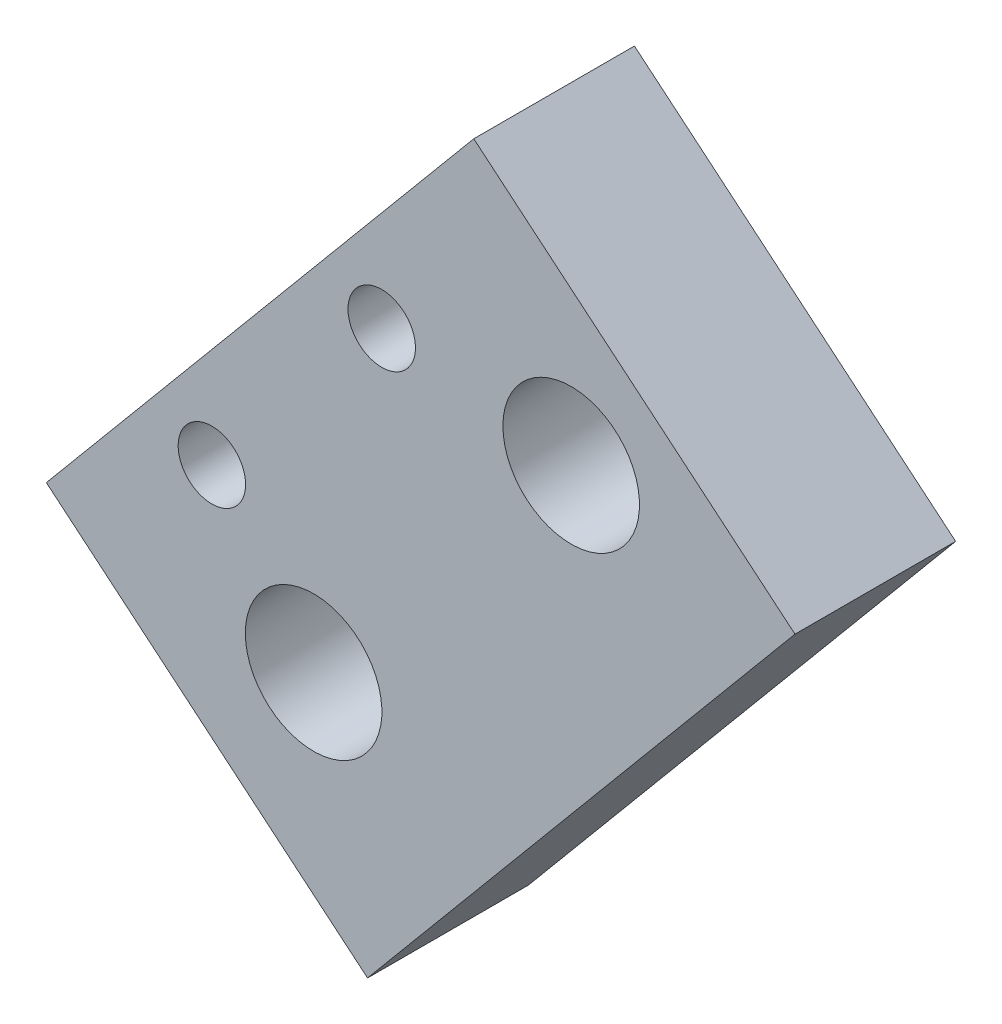
ISO-10303-21;
HEADER;
FILE_DESCRIPTION(('STEP AP214'),'2;1');
FILE_NAME('part.step','',(''),(''),'','','');
FILE_SCHEMA(('AUTOMOTIVE_DESIGN { 1 0 10303 214 1 1 1 1 }'));
ENDSEC;
DATA;
#1=APPLICATION_CONTEXT('core data for automotive mechanical design processes');
#2=APPLICATION_PROTOCOL_DEFINITION('international standard','automotive_design',2000,#1);
#3=PRODUCT_CONTEXT('',#1,'mechanical');
#4=PRODUCT('Part','Part','',(#3));
#5=PRODUCT_RELATED_PRODUCT_CATEGORY('part','',(#4));
#6=PRODUCT_DEFINITION_FORMATION('','',#4);
#7=PRODUCT_DEFINITION_CONTEXT('part definition',#1,'design');
#8=PRODUCT_DEFINITION('design','',#6,#7);
#9=PRODUCT_DEFINITION_SHAPE('','',#8);
#10=(LENGTH_UNIT() NAMED_UNIT(*) SI_UNIT(.MILLI.,.METRE.));
#11=(NAMED_UNIT(*) PLANE_ANGLE_UNIT() SI_UNIT($,.RADIAN.));
#12=(NAMED_UNIT(*) SI_UNIT($,.STERADIAN.) SOLID_ANGLE_UNIT());
#13=UNCERTAINTY_MEASURE_WITH_UNIT(LENGTH_MEASURE(1.E-05),#10,'distance_accuracy_value','');
#14=(GEOMETRIC_REPRESENTATION_CONTEXT(3) GLOBAL_UNCERTAINTY_ASSIGNED_CONTEXT((#13)) GLOBAL_UNIT_ASSIGNED_CONTEXT((#10,
#11,#12)) REPRESENTATION_CONTEXT('',''));
#15=CARTESIAN_POINT('',(0.,0.,0.));
#16=DIRECTION('',(0.,0.,1.));
#17=DIRECTION('',(1.,0.,0.));
#18=AXIS2_PLACEMENT_3D('',#15,#16,#17);
#19=CARTESIAN_POINT('',(0.,0.,3296.87018726518));
#20=DIRECTION('',(0.,0.,-1.));
#21=DIRECTION('',(-1.,0.,0.));
#22=AXIS2_PLACEMENT_3D('',#19,#20,#21);
#23=PLANE('',#22);
#24=CARTESIAN_POINT('',(93.357902825932,530.766140136634,3296.87018726518));
#25=DIRECTION('',(0.,0.,-1.));
#26=DIRECTION('',(-1.,0.,0.));
#27=AXIS2_PLACEMENT_3D('',#24,#25,#26);
#28=CIRCLE('',#27,4.24999999999999);
#29=CARTESIAN_POINT('',(89.107902825932,530.766140136634,3296.87018726518));
#30=VERTEX_POINT('',#29);
#31=EDGE_CURVE('E121',#30,#30,#28,.T.);
#32=ORIENTED_EDGE('',*,*,#31,.F.);
#33=EDGE_LOOP('',(#32));
#34=FACE_BOUND('',#33,.T.);
#35=CARTESIAN_POINT('',(77.3269662880733,511.582577544687,3296.87018726518));
#36=DIRECTION('',(0.,0.,-1.));
#37=DIRECTION('',(-1.,0.,0.));
#38=AXIS2_PLACEMENT_3D('',#35,#36,#37);
#39=CIRCLE('',#38,4.24999999999998);
#40=CARTESIAN_POINT('',(73.0769662880733,511.582577544687,3296.87018726518));
#41=VERTEX_POINT('',#40);
#42=EDGE_CURVE('E100',#41,#41,#39,.T.);
#43=ORIENTED_EDGE('',*,*,#42,.F.);
#44=EDGE_LOOP('',(#43));
#45=FACE_BOUND('',#44,.T.);
#46=DIRECTION('',(-0.641237461514351,-0.767342503677876,0.));
#47=VECTOR('',#46,1.);
#48=CARTESIAN_POINT('',(107.287132076453,528.630767377992,3296.87018726518));
#49=LINE('',#48,#47);
#50=CARTESIAN_POINT('',(107.287132076453,528.630767377992,3296.87018726518));
#51=VERTEX_POINT('',#50);
#52=CARTESIAN_POINT('',(80.6837556077913,496.795600640325,3296.87018726518));
#53=VERTEX_POINT('',#52);
#54=EDGE_CURVE('E85',#51,#53,#49,.T.);
#55=ORIENTED_EDGE('',*,*,#54,.T.);
#56=DIRECTION('',(-0.767342503677874,0.641237461514354,0.));
#57=VECTOR('',#56,1.);
#58=CARTESIAN_POINT('',(80.6837556077913,496.795600640325,3296.87018726518));
#59=LINE('',#58,#57);
#60=CARTESIAN_POINT('',(60.692285166123,513.501673478089,3296.87018726518));
#61=VERTEX_POINT('',#60);
#62=EDGE_CURVE('E80',#53,#61,#59,.T.);
#63=ORIENTED_EDGE('',*,*,#62,.T.);
#64=DIRECTION('',(0.641237461514352,0.767342503677875,0.));
#65=VECTOR('',#64,1.);
#66=CARTESIAN_POINT('',(87.2956616347843,545.336840215756,3296.87018726518));
#67=LINE('',#66,#65);
#68=CARTESIAN_POINT('',(87.2956616347843,545.336840215756,3296.87018726518));
#69=VERTEX_POINT('',#68);
#70=EDGE_CURVE('E83',#61,#69,#67,.T.);
#71=ORIENTED_EDGE('',*,*,#70,.T.);
#72=DIRECTION('',(0.767342503677875,-0.641237461514352,0.));
#73=VECTOR('',#72,1.);
#74=CARTESIAN_POINT('',(107.287132076453,528.630767377992,3296.87018726518));
#75=LINE('',#74,#73);
#76=EDGE_CURVE('E50',#69,#51,#75,.T.);
#77=ORIENTED_EDGE('',*,*,#76,.T.);
#78=EDGE_LOOP('',(#55,#63,#71,#77));
#79=FACE_BOUND('',#78,.T.);
#80=CARTESIAN_POINT('',(81.5669368911053,532.251222864898,3296.87018726518));
#81=DIRECTION('',(0.,0.,-1.));
#82=DIRECTION('',(-1.,0.,0.));
#83=AXIS2_PLACEMENT_3D('',#80,#81,#82);
#84=CIRCLE('',#83,2.09999999999989);
#85=CARTESIAN_POINT('',(79.4669368911054,532.251222864898,3296.87018726518));
#86=VERTEX_POINT('',#85);
#87=EDGE_CURVE('E115',#86,#86,#84,.T.);
#88=ORIENTED_EDGE('',*,*,#87,.F.);
#89=EDGE_LOOP('',(#88));
#90=FACE_BOUND('',#89,.T.);
#91=CARTESIAN_POINT('',(70.9944969603028,519.599618719178,3296.87018726518));
#92=DIRECTION('',(0.,0.,-1.));
#93=DIRECTION('',(-1.,0.,0.));
#94=AXIS2_PLACEMENT_3D('',#91,#92,#93);
#95=CIRCLE('',#94,2.09999999999995);
#96=CARTESIAN_POINT('',(68.8944969603028,519.599618719178,3296.87018726518));
#97=VERTEX_POINT('',#96);
#98=EDGE_CURVE('E127',#97,#97,#95,.T.);
#99=ORIENTED_EDGE('',*,*,#98,.F.);
#100=EDGE_LOOP('',(#99));
#101=FACE_BOUND('',#100,.T.);
#102=ADVANCED_FACE('F33',(#34,#45,#79,#90,#101),#23,.T.);
#103=CARTESIAN_POINT('',(0.,0.,3306.87018726518));
#104=DIRECTION('',(0.,0.,-1.));
#105=DIRECTION('',(-1.,0.,0.));
#106=AXIS2_PLACEMENT_3D('',#103,#104,#105);
#107=PLANE('',#106);
#108=DIRECTION('',(-0.641237461514351,-0.767342503677876,0.));
#109=VECTOR('',#108,1.);
#110=CARTESIAN_POINT('',(107.287132076453,528.630767377992,3306.87018726518));
#111=LINE('',#110,#109);
#112=CARTESIAN_POINT('',(107.287132076453,528.630767377992,3306.87018726518));
#113=VERTEX_POINT('',#112);
#114=CARTESIAN_POINT('',(80.6837556077913,496.795600640325,3306.87018726518));
#115=VERTEX_POINT('',#114);
#116=EDGE_CURVE('E97',#113,#115,#111,.T.);
#117=ORIENTED_EDGE('',*,*,#116,.F.);
#118=DIRECTION('',(0.767342503677875,-0.641237461514352,0.));
#119=VECTOR('',#118,1.);
#120=CARTESIAN_POINT('',(107.287132076453,528.630767377992,3306.87018726518));
#121=LINE('',#120,#119);
#122=CARTESIAN_POINT('',(87.2956616347843,545.336840215756,3306.87018726518));
#123=VERTEX_POINT('',#122);
#124=EDGE_CURVE('E73',#123,#113,#121,.T.);
#125=ORIENTED_EDGE('',*,*,#124,.F.);
#126=DIRECTION('',(0.641237461514352,0.767342503677875,0.));
#127=VECTOR('',#126,1.);
#128=CARTESIAN_POINT('',(87.2956616347843,545.336840215756,3306.87018726518));
#129=LINE('',#128,#127);
#130=CARTESIAN_POINT('',(60.692285166123,513.501673478089,3306.87018726518));
#131=VERTEX_POINT('',#130);
#132=EDGE_CURVE('E67',#131,#123,#129,.T.);
#133=ORIENTED_EDGE('',*,*,#132,.F.);
#134=DIRECTION('',(-0.767342503677874,0.641237461514354,0.));
#135=VECTOR('',#134,1.);
#136=CARTESIAN_POINT('',(80.6837556077913,496.795600640325,3306.87018726518));
#137=LINE('',#136,#135);
#138=EDGE_CURVE('E89',#115,#131,#137,.T.);
#139=ORIENTED_EDGE('',*,*,#138,.F.);
#140=EDGE_LOOP('',(#117,#125,#133,#139));
#141=FACE_BOUND('',#140,.T.);
#142=CARTESIAN_POINT('',(77.3269662880733,511.582577544687,3306.87018726518));
#143=DIRECTION('',(0.,0.,-1.));
#144=DIRECTION('',(-1.,0.,0.));
#145=AXIS2_PLACEMENT_3D('',#142,#143,#144);
#146=CIRCLE('',#145,4.24999999999998);
#147=CARTESIAN_POINT('',(73.0769662880733,511.582577544687,3306.87018726518));
#148=VERTEX_POINT('',#147);
#149=EDGE_CURVE('E112',#148,#148,#146,.T.);
#150=ORIENTED_EDGE('',*,*,#149,.T.);
#151=EDGE_LOOP('',(#150));
#152=FACE_BOUND('',#151,.T.);
#153=CARTESIAN_POINT('',(81.5669368911053,532.251222864898,3306.87018726518));
#154=DIRECTION('',(0.,0.,-1.));
#155=DIRECTION('',(-1.,0.,0.));
#156=AXIS2_PLACEMENT_3D('',#153,#154,#155);
#157=CIRCLE('',#156,2.09999999999989);
#158=CARTESIAN_POINT('',(79.4669368911054,532.251222864898,3306.87018726518));
#159=VERTEX_POINT('',#158);
#160=EDGE_CURVE('E118',#159,#159,#157,.T.);
#161=ORIENTED_EDGE('',*,*,#160,.T.);
#162=EDGE_LOOP('',(#161));
#163=FACE_BOUND('',#162,.T.);
#164=CARTESIAN_POINT('',(93.357902825932,530.766140136634,3306.87018726518));
#165=DIRECTION('',(0.,0.,-1.));
#166=DIRECTION('',(-1.,0.,0.));
#167=AXIS2_PLACEMENT_3D('',#164,#165,#166);
#168=CIRCLE('',#167,4.24999999999999);
#169=CARTESIAN_POINT('',(89.107902825932,530.766140136634,3306.87018726518));
#170=VERTEX_POINT('',#169);
#171=EDGE_CURVE('E124',#170,#170,#168,.T.);
#172=ORIENTED_EDGE('',*,*,#171,.T.);
#173=EDGE_LOOP('',(#172));
#174=FACE_BOUND('',#173,.T.);
#175=CARTESIAN_POINT('',(70.9944969603028,519.599618719178,3306.87018726518));
#176=DIRECTION('',(0.,0.,-1.));
#177=DIRECTION('',(-1.,0.,0.));
#178=AXIS2_PLACEMENT_3D('',#175,#176,#177);
#179=CIRCLE('',#178,2.09999999999995);
#180=CARTESIAN_POINT('',(68.8944969603028,519.599618719178,3306.87018726518));
#181=VERTEX_POINT('',#180);
#182=EDGE_CURVE('E130',#181,#181,#179,.T.);
#183=ORIENTED_EDGE('',*,*,#182,.T.);
#184=EDGE_LOOP('',(#183));
#185=FACE_BOUND('',#184,.T.);
#186=ADVANCED_FACE('F108',(#141,#152,#163,#174,#185),#107,.F.);
#187=CARTESIAN_POINT('',(107.287132076453,528.630767377992,3296.87018726518));
#188=DIRECTION('',(-0.767342503677876,0.641237461514351,0.));
#189=DIRECTION('',(-0.641237461514351,-0.767342503677876,0.));
#190=AXIS2_PLACEMENT_3D('',#187,#188,#189);
#191=PLANE('',#190);
#192=ORIENTED_EDGE('',*,*,#116,.T.);
#193=DIRECTION('',(0.,0.,1.));
#194=VECTOR('',#193,1.);
#195=CARTESIAN_POINT('',(80.6837556077913,496.795600640325,3296.87018726518));
#196=LINE('',#195,#194);
#197=EDGE_CURVE('E11',#53,#115,#196,.T.);
#198=ORIENTED_EDGE('',*,*,#197,.F.);
#199=ORIENTED_EDGE('',*,*,#54,.F.);
#200=DIRECTION('',(0.,0.,1.));
#201=VECTOR('',#200,1.);
#202=CARTESIAN_POINT('',(107.287132076453,528.630767377992,3296.87018726518));
#203=LINE('',#202,#201);
#204=EDGE_CURVE('E93',#51,#113,#203,.T.);
#205=ORIENTED_EDGE('',*,*,#204,.T.);
#206=EDGE_LOOP('',(#192,#198,#199,#205));
#207=FACE_BOUND('',#206,.T.);
#208=ADVANCED_FACE('F35',(#207),#191,.F.);
#209=CARTESIAN_POINT('',(80.6837556077913,496.795600640325,3296.87018726518));
#210=DIRECTION('',(0.641237461514354,0.767342503677874,0.));
#211=DIRECTION('',(-0.767342503677874,0.641237461514354,0.));
#212=AXIS2_PLACEMENT_3D('',#209,#210,#211);
#213=PLANE('',#212);
#214=ORIENTED_EDGE('',*,*,#138,.T.);
#215=DIRECTION('',(0.,0.,1.));
#216=VECTOR('',#215,1.);
#217=CARTESIAN_POINT('',(60.692285166123,513.501673478089,3296.87018726518));
#218=LINE('',#217,#216);
#219=EDGE_CURVE('E42',#61,#131,#218,.T.);
#220=ORIENTED_EDGE('',*,*,#219,.F.);
#221=ORIENTED_EDGE('',*,*,#62,.F.);
#222=ORIENTED_EDGE('',*,*,#197,.T.);
#223=EDGE_LOOP('',(#214,#220,#221,#222));
#224=FACE_BOUND('',#223,.T.);
#225=ADVANCED_FACE('F88',(#224),#213,.F.);
#226=CARTESIAN_POINT('',(87.2956616347843,545.336840215756,3296.87018726518));
#227=DIRECTION('',(0.767342503677875,-0.641237461514352,0.));
#228=DIRECTION('',(0.641237461514352,0.767342503677875,0.));
#229=AXIS2_PLACEMENT_3D('',#226,#227,#228);
#230=PLANE('',#229);
#231=ORIENTED_EDGE('',*,*,#132,.T.);
#232=DIRECTION('',(0.,0.,1.));
#233=VECTOR('',#232,1.);
#234=CARTESIAN_POINT('',(87.2956616347843,545.336840215756,3296.87018726518));
#235=LINE('',#234,#233);
#236=EDGE_CURVE('E90',#69,#123,#235,.T.);
#237=ORIENTED_EDGE('',*,*,#236,.F.);
#238=ORIENTED_EDGE('',*,*,#70,.F.);
#239=ORIENTED_EDGE('',*,*,#219,.T.);
#240=EDGE_LOOP('',(#231,#237,#238,#239));
#241=FACE_BOUND('',#240,.T.);
#242=ADVANCED_FACE('F91',(#241),#230,.F.);
#243=CARTESIAN_POINT('',(107.287132076453,528.630767377992,3296.87018726518));
#244=DIRECTION('',(-0.641237461514352,-0.767342503677875,0.));
#245=DIRECTION('',(0.767342503677875,-0.641237461514352,0.));
#246=AXIS2_PLACEMENT_3D('',#243,#244,#245);
#247=PLANE('',#246);
#248=ORIENTED_EDGE('',*,*,#124,.T.);
#249=ORIENTED_EDGE('',*,*,#204,.F.);
#250=ORIENTED_EDGE('',*,*,#76,.F.);
#251=ORIENTED_EDGE('',*,*,#236,.T.);
#252=EDGE_LOOP('',(#248,#249,#250,#251));
#253=FACE_BOUND('',#252,.T.);
#254=ADVANCED_FACE('F105',(#253),#247,.F.);
#255=CARTESIAN_POINT('',(77.3269662880733,511.582577544687,3296.87018726518));
#256=DIRECTION('',(0.,0.,1.));
#257=DIRECTION('',(1.,0.,0.));
#258=AXIS2_PLACEMENT_3D('',#255,#256,#257);
#259=CYLINDRICAL_SURFACE('',#258,4.24999999999998);
#260=ORIENTED_EDGE('',*,*,#42,.T.);
#261=EDGE_LOOP('',(#260));
#262=FACE_BOUND('',#261,.T.);
#263=ORIENTED_EDGE('',*,*,#149,.F.);
#264=EDGE_LOOP('',(#263));
#265=FACE_BOUND('',#264,.T.);
#266=ADVANCED_FACE('F149',(#262,#265),#259,.F.);
#267=CARTESIAN_POINT('',(81.5669368911053,532.251222864898,3296.87018726518));
#268=DIRECTION('',(0.,0.,1.));
#269=DIRECTION('',(1.,0.,0.));
#270=AXIS2_PLACEMENT_3D('',#267,#268,#269);
#271=CYLINDRICAL_SURFACE('',#270,2.09999999999989);
#272=ORIENTED_EDGE('',*,*,#87,.T.);
#273=EDGE_LOOP('',(#272));
#274=FACE_BOUND('',#273,.T.);
#275=ORIENTED_EDGE('',*,*,#160,.F.);
#276=EDGE_LOOP('',(#275));
#277=FACE_BOUND('',#276,.T.);
#278=ADVANCED_FACE('F195',(#274,#277),#271,.F.);
#279=CARTESIAN_POINT('',(93.357902825932,530.766140136634,3296.87018726518));
#280=DIRECTION('',(0.,0.,1.));
#281=DIRECTION('',(1.,0.,0.));
#282=AXIS2_PLACEMENT_3D('',#279,#280,#281);
#283=CYLINDRICAL_SURFACE('',#282,4.24999999999999);
#284=ORIENTED_EDGE('',*,*,#31,.T.);
#285=EDGE_LOOP('',(#284));
#286=FACE_BOUND('',#285,.T.);
#287=ORIENTED_EDGE('',*,*,#171,.F.);
#288=EDGE_LOOP('',(#287));
#289=FACE_BOUND('',#288,.T.);
#290=ADVANCED_FACE('F203',(#286,#289),#283,.F.);
#291=CARTESIAN_POINT('',(70.9944969603028,519.599618719178,3296.87018726518));
#292=DIRECTION('',(0.,0.,1.));
#293=DIRECTION('',(1.,0.,0.));
#294=AXIS2_PLACEMENT_3D('',#291,#292,#293);
#295=CYLINDRICAL_SURFACE('',#294,2.09999999999995);
#296=ORIENTED_EDGE('',*,*,#98,.T.);
#297=EDGE_LOOP('',(#296));
#298=FACE_BOUND('',#297,.T.);
#299=ORIENTED_EDGE('',*,*,#182,.F.);
#300=EDGE_LOOP('',(#299));
#301=FACE_BOUND('',#300,.T.);
#302=ADVANCED_FACE('F136',(#298,#301),#295,.F.);
#303=CLOSED_SHELL('',(#102,#186,#208,#225,#242,#254,#266,#278,#290,#302));
#304=MANIFOLD_SOLID_BREP('B2',#303);
#305=ADVANCED_BREP_SHAPE_REPRESENTATION('',(#18,#304),#14);
#306=SHAPE_DEFINITION_REPRESENTATION(#9,#305);
ENDSEC;
END-ISO-10303-21;
